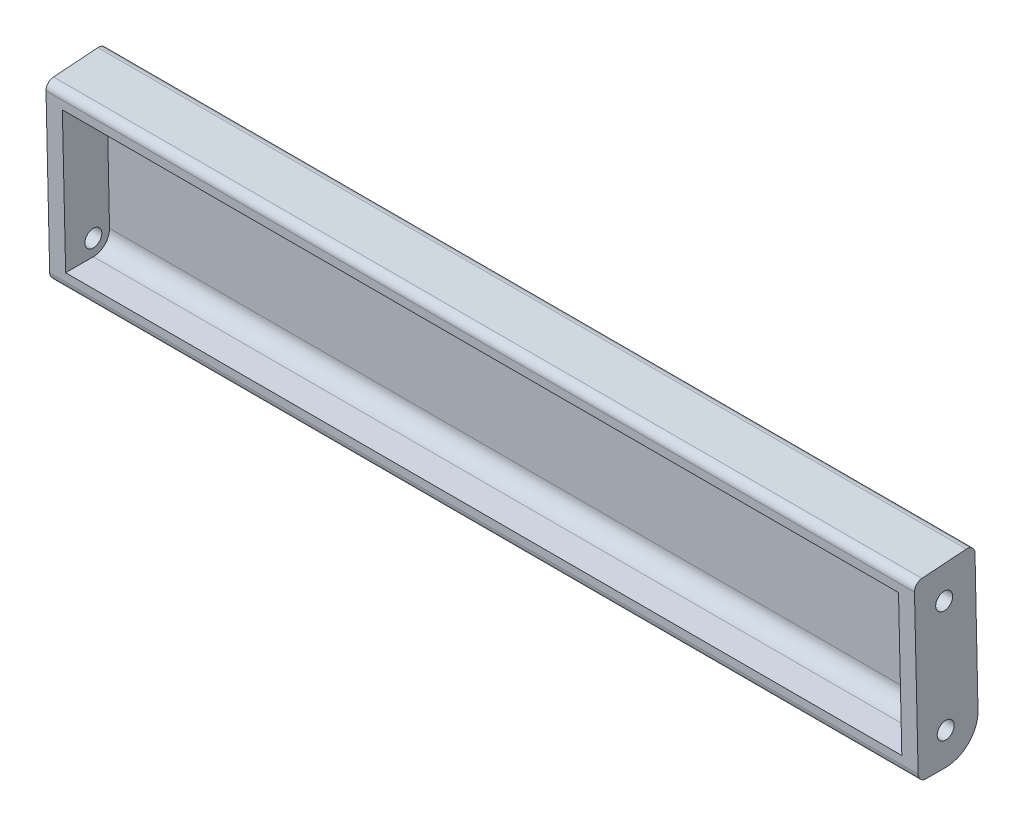
ISO-10303-21;
HEADER;
FILE_DESCRIPTION(('STEP AP214'),'2;1');
FILE_NAME('part.step','',(''),(''),'','','');
FILE_SCHEMA(('AUTOMOTIVE_DESIGN { 1 0 10303 214 1 1 1 1 }'));
ENDSEC;
DATA;
#1=APPLICATION_CONTEXT('core data for automotive mechanical design processes');
#2=APPLICATION_PROTOCOL_DEFINITION('international standard','automotive_design',2000,#1);
#3=PRODUCT_CONTEXT('',#1,'mechanical');
#4=PRODUCT('Part','Part','',(#3));
#5=PRODUCT_RELATED_PRODUCT_CATEGORY('part','',(#4));
#6=PRODUCT_DEFINITION_FORMATION('','',#4);
#7=PRODUCT_DEFINITION_CONTEXT('part definition',#1,'design');
#8=PRODUCT_DEFINITION('design','',#6,#7);
#9=PRODUCT_DEFINITION_SHAPE('','',#8);
#10=(LENGTH_UNIT() NAMED_UNIT(*) SI_UNIT(.MILLI.,.METRE.));
#11=(NAMED_UNIT(*) PLANE_ANGLE_UNIT() SI_UNIT($,.RADIAN.));
#12=(NAMED_UNIT(*) SI_UNIT($,.STERADIAN.) SOLID_ANGLE_UNIT());
#13=UNCERTAINTY_MEASURE_WITH_UNIT(LENGTH_MEASURE(1.E-05),#10,'distance_accuracy_value','');
#14=(GEOMETRIC_REPRESENTATION_CONTEXT(3) GLOBAL_UNCERTAINTY_ASSIGNED_CONTEXT((#13)) GLOBAL_UNIT_ASSIGNED_CONTEXT((#10,
#11,#12)) REPRESENTATION_CONTEXT('',''));
#15=CARTESIAN_POINT('',(0.,0.,0.));
#16=DIRECTION('',(0.,0.,1.));
#17=DIRECTION('',(1.,0.,0.));
#18=AXIS2_PLACEMENT_3D('',#15,#16,#17);
#19=CARTESIAN_POINT('',(215.,26.5821643220677,-62.5359087014566));
#20=DIRECTION('',(0.,0.0230443954174687,-0.999734442659571));
#21=DIRECTION('',(0.,0.999734442659571,0.0230443954174687));
#22=AXIS2_PLACEMENT_3D('',#19,#20,#21);
#23=PLANE('',#22);
#24=DIRECTION('',(0.,-0.999734442659571,-0.0230443954174687));
#25=VECTOR('',#24,1.);
#26=CARTESIAN_POINT('',(0.,26.5821643220677,-62.5359087014566));
#27=LINE('',#26,#25);
#28=CARTESIAN_POINT('',(0.,26.5821643220677,-62.5359087014566));
#29=VERTEX_POINT('',#28);
#30=CARTESIAN_POINT('',(0.,-12.9045774683221,-63.4460985006042));
#31=VERTEX_POINT('',#30);
#32=EDGE_CURVE('E199',#29,#31,#27,.T.);
#33=ORIENTED_EDGE('',*,*,#32,.T.);
#34=DIRECTION('',(-1.,0.,0.));
#35=VECTOR('',#34,1.);
#36=CARTESIAN_POINT('',(215.,-12.9045774683221,-63.4460985006042));
#37=LINE('',#36,#35);
#38=CARTESIAN_POINT('',(215.,-12.9045774683221,-63.4460985006042));
#39=VERTEX_POINT('',#38);
#40=EDGE_CURVE('E229',#39,#31,#37,.T.);
#41=ORIENTED_EDGE('',*,*,#40,.F.);
#42=DIRECTION('',(0.,-0.999734442659571,-0.0230443954174687));
#43=VECTOR('',#42,1.);
#44=CARTESIAN_POINT('',(215.,26.5821643220677,-62.5359087014566));
#45=LINE('',#44,#43);
#46=CARTESIAN_POINT('',(215.,26.5821643220677,-62.5359087014566));
#47=VERTEX_POINT('',#46);
#48=EDGE_CURVE('E181',#47,#39,#45,.T.);
#49=ORIENTED_EDGE('',*,*,#48,.F.);
#50=DIRECTION('',(-1.,0.,0.));
#51=VECTOR('',#50,1.);
#52=CARTESIAN_POINT('',(215.,26.5821643220677,-62.5359087014566));
#53=LINE('',#52,#51);
#54=EDGE_CURVE('E232',#47,#29,#53,.T.);
#55=ORIENTED_EDGE('',*,*,#54,.T.);
#56=EDGE_LOOP('',(#33,#41,#49,#55));
#57=FACE_BOUND('',#56,.T.);
#58=DIRECTION('',(0.,-0.999734442659571,-0.0230443954174687));
#59=VECTOR('',#58,1.);
#60=CARTESIAN_POINT('',(4.,26.5821643220677,-62.5359087014566));
#61=LINE('',#60,#59);
#62=CARTESIAN_POINT('',(4.,24.4841879367445,-62.5842681410607));
#63=VERTEX_POINT('',#62);
#64=CARTESIAN_POINT('',(4.,-10.8584886774871,-63.3989350968609));
#65=VERTEX_POINT('',#64);
#66=EDGE_CURVE('E136',#63,#65,#61,.T.);
#67=ORIENTED_EDGE('',*,*,#66,.F.);
#68=DIRECTION('',(-1.,0.,0.));
#69=VECTOR('',#68,1.);
#70=CARTESIAN_POINT('',(215.,24.4841879367445,-62.5842681410607));
#71=LINE('',#70,#69);
#72=CARTESIAN_POINT('',(211.,24.4841879367445,-62.5842681410607));
#73=VERTEX_POINT('',#72);
#74=EDGE_CURVE('E170',#73,#63,#71,.T.);
#75=ORIENTED_EDGE('',*,*,#74,.F.);
#76=DIRECTION('',(0.,-0.999734442659571,-0.0230443954174687));
#77=VECTOR('',#76,1.);
#78=CARTESIAN_POINT('',(211.,26.5821643220677,-62.5359087014566));
#79=LINE('',#78,#77);
#80=CARTESIAN_POINT('',(211.,-10.8584886774871,-63.3989350968609));
#81=VERTEX_POINT('',#80);
#82=EDGE_CURVE('E167',#73,#81,#79,.T.);
#83=ORIENTED_EDGE('',*,*,#82,.T.);
#84=DIRECTION('',(-1.,0.,0.));
#85=VECTOR('',#84,1.);
#86=CARTESIAN_POINT('',(215.,-10.8584886774871,-63.3989350968609));
#87=LINE('',#86,#85);
#88=EDGE_CURVE('E147',#81,#65,#87,.T.);
#89=ORIENTED_EDGE('',*,*,#88,.T.);
#90=EDGE_LOOP('',(#67,#75,#83,#89));
#91=FACE_BOUND('',#90,.T.);
#92=ADVANCED_FACE('F32',(#57,#91),#23,.F.);
#93=CARTESIAN_POINT('',(215.,26.6282531129027,-64.5353775867758));
#94=DIRECTION('',(-1.,0.,0.));
#95=DIRECTION('',(0.,0.,1.));
#96=AXIS2_PLACEMENT_3D('',#93,#94,#95);
#97=CYLINDRICAL_SURFACE('',#96,2.);
#98=CARTESIAN_POINT('',(0.,26.6282531129027,-64.5353775867758));
#99=DIRECTION('',(1.,0.,0.));
#100=DIRECTION('',(0.,0.,-1.));
#101=AXIS2_PLACEMENT_3D('',#98,#99,#100);
#102=CIRCLE('',#101,2.);
#103=CARTESIAN_POINT('',(0.,28.6231972505984,-64.3932583147773));
#104=VERTEX_POINT('',#103);
#105=EDGE_CURVE('E175',#104,#29,#102,.T.);
#106=ORIENTED_EDGE('',*,*,#105,.T.);
#107=ORIENTED_EDGE('',*,*,#54,.F.);
#108=CARTESIAN_POINT('',(215.,26.6282531129027,-64.5353775867758));
#109=DIRECTION('',(1.,0.,0.));
#110=DIRECTION('',(0.,0.,-1.));
#111=AXIS2_PLACEMENT_3D('',#108,#109,#110);
#112=CIRCLE('',#111,2.);
#113=CARTESIAN_POINT('',(215.,28.6231972505984,-64.3932583147773));
#114=VERTEX_POINT('',#113);
#115=EDGE_CURVE('E178',#114,#47,#112,.T.);
#116=ORIENTED_EDGE('',*,*,#115,.F.);
#117=DIRECTION('',(-1.,0.,0.));
#118=VECTOR('',#117,1.);
#119=CARTESIAN_POINT('',(215.,28.6231972505984,-64.3932583147773));
#120=LINE('',#119,#118);
#121=EDGE_CURVE('E196',#114,#104,#120,.T.);
#122=ORIENTED_EDGE('',*,*,#121,.T.);
#123=EDGE_LOOP('',(#106,#107,#116,#122));
#124=FACE_BOUND('',#123,.T.);
#125=ADVANCED_FACE('F259',(#124),#97,.T.);
#126=CARTESIAN_POINT('',(215.,-12.8584886774871,-65.4455673859233));
#127=DIRECTION('',(-1.,0.,0.));
#128=DIRECTION('',(0.,0.,1.));
#129=AXIS2_PLACEMENT_3D('',#126,#127,#128);
#130=CYLINDRICAL_SURFACE('',#129,2.);
#131=CARTESIAN_POINT('',(0.,-12.8584886774871,-65.4455673859233));
#132=DIRECTION('',(1.,0.,0.));
#133=DIRECTION('',(0.,0.,1.));
#134=AXIS2_PLACEMENT_3D('',#131,#132,#133);
#135=CIRCLE('',#134,2.);
#136=CARTESIAN_POINT('',(0.,-14.8584886774871,-65.4455673859234));
#137=VERTEX_POINT('',#136);
#138=EDGE_CURVE('E201',#31,#137,#135,.T.);
#139=ORIENTED_EDGE('',*,*,#138,.T.);
#140=DIRECTION('',(-1.,0.,0.));
#141=VECTOR('',#140,1.);
#142=CARTESIAN_POINT('',(215.,-14.8584886774871,-65.4455673859234));
#143=LINE('',#142,#141);
#144=CARTESIAN_POINT('',(215.,-14.8584886774871,-65.4455673859234));
#145=VERTEX_POINT('',#144);
#146=EDGE_CURVE('E226',#145,#137,#143,.T.);
#147=ORIENTED_EDGE('',*,*,#146,.F.);
#148=CARTESIAN_POINT('',(215.,-12.8584886774871,-65.4455673859233));
#149=DIRECTION('',(1.,0.,0.));
#150=DIRECTION('',(0.,0.,1.));
#151=AXIS2_PLACEMENT_3D('',#148,#149,#150);
#152=CIRCLE('',#151,2.);
#153=EDGE_CURVE('E184',#39,#145,#152,.T.);
#154=ORIENTED_EDGE('',*,*,#153,.F.);
#155=ORIENTED_EDGE('',*,*,#40,.T.);
#156=EDGE_LOOP('',(#139,#147,#154,#155));
#157=FACE_BOUND('',#156,.T.);
#158=ADVANCED_FACE('F265',(#157),#130,.T.);
#159=CARTESIAN_POINT('',(215.,-14.8584886774871,-70.2619743209976));
#160=DIRECTION('',(0.,1.,0.));
#161=DIRECTION('',(0.,0.,1.));
#162=AXIS2_PLACEMENT_3D('',#159,#160,#161);
#163=PLANE('',#162);
#164=DIRECTION('',(0.,0.,-1.));
#165=VECTOR('',#164,1.);
#166=CARTESIAN_POINT('',(0.,-14.8584886774871,-70.2619743209976));
#167=LINE('',#166,#165);
#168=CARTESIAN_POINT('',(0.,-14.8584886774871,-70.2619743209976));
#169=VERTEX_POINT('',#168);
#170=EDGE_CURVE('E203',#137,#169,#167,.T.);
#171=ORIENTED_EDGE('',*,*,#170,.T.);
#172=DIRECTION('',(-1.,0.,0.));
#173=VECTOR('',#172,1.);
#174=CARTESIAN_POINT('',(215.,-14.8584886774871,-70.2619743209976));
#175=LINE('',#174,#173);
#176=CARTESIAN_POINT('',(215.,-14.8584886774871,-70.2619743209976));
#177=VERTEX_POINT('',#176);
#178=EDGE_CURVE('E223',#177,#169,#175,.T.);
#179=ORIENTED_EDGE('',*,*,#178,.F.);
#180=DIRECTION('',(0.,0.,-1.));
#181=VECTOR('',#180,1.);
#182=CARTESIAN_POINT('',(215.,-14.8584886774871,-70.2619743209976));
#183=LINE('',#182,#181);
#184=EDGE_CURVE('E186',#145,#177,#183,.T.);
#185=ORIENTED_EDGE('',*,*,#184,.F.);
#186=ORIENTED_EDGE('',*,*,#146,.T.);
#187=EDGE_LOOP('',(#171,#179,#185,#186));
#188=FACE_BOUND('',#187,.T.);
#189=ADVANCED_FACE('F270',(#188),#163,.F.);
#190=CARTESIAN_POINT('',(215.,-6.85848867748714,-70.2619743209977));
#191=DIRECTION('',(-1.,0.,0.));
#192=DIRECTION('',(0.,0.,1.));
#193=AXIS2_PLACEMENT_3D('',#190,#191,#192);
#194=CYLINDRICAL_SURFACE('',#193,8.);
#195=CARTESIAN_POINT('',(0.,-6.85848867748714,-70.2619743209977));
#196=DIRECTION('',(1.,0.,0.));
#197=DIRECTION('',(0.,0.,1.));
#198=AXIS2_PLACEMENT_3D('',#195,#196,#197);
#199=CIRCLE('',#198,8.);
#200=CARTESIAN_POINT('',(0.,-6.67527630251636,-78.2598761224489));
#201=VERTEX_POINT('',#200);
#202=EDGE_CURVE('E205',#169,#201,#199,.T.);
#203=ORIENTED_EDGE('',*,*,#202,.T.);
#204=DIRECTION('',(-1.,0.,0.));
#205=VECTOR('',#204,1.);
#206=CARTESIAN_POINT('',(215.,-6.67527630251636,-78.2598761224489));
#207=LINE('',#206,#205);
#208=CARTESIAN_POINT('',(215.,-6.67527630251636,-78.2598761224489));
#209=VERTEX_POINT('',#208);
#210=EDGE_CURVE('E220',#209,#201,#207,.T.);
#211=ORIENTED_EDGE('',*,*,#210,.F.);
#212=CARTESIAN_POINT('',(215.,-6.85848867748714,-70.2619743209977));
#213=DIRECTION('',(1.,0.,0.));
#214=DIRECTION('',(0.,0.,1.));
#215=AXIS2_PLACEMENT_3D('',#212,#213,#214);
#216=CIRCLE('',#215,8.);
#217=EDGE_CURVE('E188',#177,#209,#216,.T.);
#218=ORIENTED_EDGE('',*,*,#217,.F.);
#219=ORIENTED_EDGE('',*,*,#178,.T.);
#220=EDGE_LOOP('',(#203,#211,#218,#219));
#221=FACE_BOUND('',#220,.T.);
#222=ADVANCED_FACE('F274',(#221),#194,.T.);
#223=CARTESIAN_POINT('',(215.,27.4541901626859,-77.521211792415));
#224=DIRECTION('',(0.,-0.0216379411918925,0.999765872342608));
#225=DIRECTION('',(0.,-0.999765872342608,-0.0216379411918925));
#226=AXIS2_PLACEMENT_3D('',#223,#224,#225);
#227=PLANE('',#226);
#228=DIRECTION('',(0.,0.999765872342608,0.0216379411918925));
#229=VECTOR('',#228,1.);
#230=CARTESIAN_POINT('',(0.,27.4541901626859,-77.521211792415));
#231=LINE('',#230,#229);
#232=CARTESIAN_POINT('',(0.,27.4541901626859,-77.521211792415));
#233=VERTEX_POINT('',#232);
#234=EDGE_CURVE('E207',#201,#233,#231,.T.);
#235=ORIENTED_EDGE('',*,*,#234,.T.);
#236=DIRECTION('',(-1.,0.,0.));
#237=VECTOR('',#236,1.);
#238=CARTESIAN_POINT('',(215.,27.4541901626859,-77.521211792415));
#239=LINE('',#238,#237);
#240=CARTESIAN_POINT('',(215.,27.4541901626859,-77.521211792415));
#241=VERTEX_POINT('',#240);
#242=EDGE_CURVE('E217',#241,#233,#239,.T.);
#243=ORIENTED_EDGE('',*,*,#242,.F.);
#244=DIRECTION('',(0.,0.999765872342608,0.0216379411918925));
#245=VECTOR('',#244,1.);
#246=CARTESIAN_POINT('',(215.,27.4541901626859,-77.521211792415));
#247=LINE('',#246,#245);
#248=EDGE_CURVE('E190',#209,#241,#247,.T.);
#249=ORIENTED_EDGE('',*,*,#248,.F.);
#250=ORIENTED_EDGE('',*,*,#210,.T.);
#251=EDGE_LOOP('',(#235,#243,#249,#250));
#252=FACE_BOUND('',#251,.T.);
#253=ADVANCED_FACE('F278',(#252),#227,.F.);
#254=CARTESIAN_POINT('',(215.,27.4109142803022,-75.5216800477298));
#255=DIRECTION('',(-1.,0.,0.));
#256=DIRECTION('',(0.,0.,1.));
#257=AXIS2_PLACEMENT_3D('',#254,#255,#256);
#258=CYLINDRICAL_SURFACE('',#257,2.);
#259=CARTESIAN_POINT('',(0.,27.4109142803022,-75.5216800477298));
#260=DIRECTION('',(1.,0.,0.));
#261=DIRECTION('',(0.,0.,1.));
#262=AXIS2_PLACEMENT_3D('',#259,#260,#261);
#263=CIRCLE('',#262,2.);
#264=CARTESIAN_POINT('',(0.,29.4058584179979,-75.3795607757313));
#265=VERTEX_POINT('',#264);
#266=EDGE_CURVE('E209',#233,#265,#263,.T.);
#267=ORIENTED_EDGE('',*,*,#266,.T.);
#268=DIRECTION('',(-1.,0.,0.));
#269=VECTOR('',#268,1.);
#270=CARTESIAN_POINT('',(215.,29.4058584179979,-75.3795607757313));
#271=LINE('',#270,#269);
#272=CARTESIAN_POINT('',(215.,29.4058584179979,-75.3795607757313));
#273=VERTEX_POINT('',#272);
#274=EDGE_CURVE('E214',#273,#265,#271,.T.);
#275=ORIENTED_EDGE('',*,*,#274,.F.);
#276=CARTESIAN_POINT('',(215.,27.4109142803022,-75.5216800477298));
#277=DIRECTION('',(1.,0.,0.));
#278=DIRECTION('',(0.,0.,1.));
#279=AXIS2_PLACEMENT_3D('',#276,#277,#278);
#280=CIRCLE('',#279,2.);
#281=EDGE_CURVE('E192',#241,#273,#280,.T.);
#282=ORIENTED_EDGE('',*,*,#281,.F.);
#283=ORIENTED_EDGE('',*,*,#242,.T.);
#284=EDGE_LOOP('',(#267,#275,#282,#283));
#285=FACE_BOUND('',#284,.T.);
#286=ADVANCED_FACE('F282',(#285),#258,.T.);
#287=CARTESIAN_POINT('',(215.,28.6231972505984,-64.3932583147773));
#288=DIRECTION('',(0.,-0.997472068847873,-0.0710596359992348));
#289=DIRECTION('',(0.,0.0710596359992348,-0.997472068847873));
#290=AXIS2_PLACEMENT_3D('',#287,#288,#289);
#291=PLANE('',#290);
#292=DIRECTION('',(0.,-0.0710596359992347,0.997472068847873));
#293=VECTOR('',#292,1.);
#294=CARTESIAN_POINT('',(0.,28.6231972505984,-64.3932583147773));
#295=LINE('',#294,#293);
#296=EDGE_CURVE('E182',#265,#104,#295,.T.);
#297=ORIENTED_EDGE('',*,*,#296,.T.);
#298=ORIENTED_EDGE('',*,*,#121,.F.);
#299=DIRECTION('',(0.,-0.0710596359992347,0.997472068847873));
#300=VECTOR('',#299,1.);
#301=CARTESIAN_POINT('',(215.,28.6231972505984,-64.3932583147773));
#302=LINE('',#301,#300);
#303=EDGE_CURVE('E194',#273,#114,#302,.T.);
#304=ORIENTED_EDGE('',*,*,#303,.F.);
#305=ORIENTED_EDGE('',*,*,#274,.T.);
#306=EDGE_LOOP('',(#297,#298,#304,#305));
#307=FACE_BOUND('',#306,.T.);
#308=ADVANCED_FACE('F286',(#307),#291,.F.);
#309=CARTESIAN_POINT('',(215.,26.6282531129027,-64.5353775867758));
#310=DIRECTION('',(1.,0.,0.));
#311=DIRECTION('',(0.,0.,-1.));
#312=AXIS2_PLACEMENT_3D('',#309,#310,#311);
#313=PLANE('',#312);
#314=CARTESIAN_POINT('',(215.,21.0145278342982,-69.8864095452543));
#315=DIRECTION('',(1.,0.,0.));
#316=DIRECTION('',(0.,0.,1.));
#317=AXIS2_PLACEMENT_3D('',#314,#315,#316);
#318=CIRCLE('',#317,2.1);
#319=CARTESIAN_POINT('',(215.,21.0145278342982,-67.7864095452543));
#320=VERTEX_POINT('',#319);
#321=EDGE_CURVE('E335',#320,#320,#318,.T.);
#322=ORIENTED_EDGE('',*,*,#321,.F.);
#323=EDGE_LOOP('',(#322));
#324=FACE_BOUND('',#323,.T.);
#325=CARTESIAN_POINT('',(215.,-6.85848867748715,-70.2619743209976));
#326=DIRECTION('',(1.,0.,0.));
#327=DIRECTION('',(0.,0.,1.));
#328=AXIS2_PLACEMENT_3D('',#325,#326,#327);
#329=CIRCLE('',#328,2.1);
#330=CARTESIAN_POINT('',(215.,-6.85848867748715,-68.1619743209976));
#331=VERTEX_POINT('',#330);
#332=EDGE_CURVE('E342',#331,#331,#329,.T.);
#333=ORIENTED_EDGE('',*,*,#332,.F.);
#334=EDGE_LOOP('',(#333));
#335=FACE_BOUND('',#334,.T.);
#336=ORIENTED_EDGE('',*,*,#115,.T.);
#337=ORIENTED_EDGE('',*,*,#48,.T.);
#338=ORIENTED_EDGE('',*,*,#153,.T.);
#339=ORIENTED_EDGE('',*,*,#184,.T.);
#340=ORIENTED_EDGE('',*,*,#217,.T.);
#341=ORIENTED_EDGE('',*,*,#248,.T.);
#342=ORIENTED_EDGE('',*,*,#281,.T.);
#343=ORIENTED_EDGE('',*,*,#303,.T.);
#344=EDGE_LOOP('',(#336,#337,#338,#339,#340,#341,#342,#343));
#345=FACE_BOUND('',#344,.T.);
#346=ADVANCED_FACE('F290',(#324,#335,#345),#313,.T.);
#347=CARTESIAN_POINT('',(0.,26.6282531129027,-64.5353775867758));
#348=DIRECTION('',(1.,0.,0.));
#349=DIRECTION('',(0.,0.,-1.));
#350=AXIS2_PLACEMENT_3D('',#347,#348,#349);
#351=PLANE('',#350);
#352=CARTESIAN_POINT('',(0.,21.0145278342982,-69.8864095452543));
#353=DIRECTION('',(1.,0.,0.));
#354=DIRECTION('',(0.,0.,1.));
#355=AXIS2_PLACEMENT_3D('',#352,#353,#354);
#356=CIRCLE('',#355,2.1);
#357=CARTESIAN_POINT('',(0.,21.0145278342982,-67.7864095452543));
#358=VERTEX_POINT('',#357);
#359=EDGE_CURVE('E240',#358,#358,#356,.T.);
#360=ORIENTED_EDGE('',*,*,#359,.T.);
#361=EDGE_LOOP('',(#360));
#362=FACE_BOUND('',#361,.T.);
#363=CARTESIAN_POINT('',(0.,-6.85848867748715,-70.2619743209976));
#364=DIRECTION('',(1.,0.,0.));
#365=DIRECTION('',(0.,0.,1.));
#366=AXIS2_PLACEMENT_3D('',#363,#364,#365);
#367=CIRCLE('',#366,2.1);
#368=CARTESIAN_POINT('',(0.,-6.85848867748715,-68.1619743209976));
#369=VERTEX_POINT('',#368);
#370=EDGE_CURVE('E345',#369,#369,#367,.T.);
#371=ORIENTED_EDGE('',*,*,#370,.T.);
#372=EDGE_LOOP('',(#371));
#373=FACE_BOUND('',#372,.T.);
#374=ORIENTED_EDGE('',*,*,#105,.F.);
#375=ORIENTED_EDGE('',*,*,#296,.F.);
#376=ORIENTED_EDGE('',*,*,#266,.F.);
#377=ORIENTED_EDGE('',*,*,#234,.F.);
#378=ORIENTED_EDGE('',*,*,#202,.F.);
#379=ORIENTED_EDGE('',*,*,#170,.F.);
#380=ORIENTED_EDGE('',*,*,#138,.F.);
#381=ORIENTED_EDGE('',*,*,#32,.F.);
#382=EDGE_LOOP('',(#374,#375,#376,#377,#378,#379,#380,#381));
#383=FACE_BOUND('',#382,.T.);
#384=ADVANCED_FACE('F292',(#362,#373,#383),#351,.F.);
#385=CARTESIAN_POINT('',(215.,-10.8584886774871,-70.2619743209976));
#386=DIRECTION('',(0.,1.,0.));
#387=DIRECTION('',(0.,0.,1.));
#388=AXIS2_PLACEMENT_3D('',#385,#386,#387);
#389=PLANE('',#388);
#390=DIRECTION('',(0.,0.,-1.));
#391=VECTOR('',#390,1.);
#392=CARTESIAN_POINT('',(4.,-10.8584886774871,-70.2619743209976));
#393=LINE('',#392,#391);
#394=CARTESIAN_POINT('',(4.,-10.8584886774871,-70.2619743209977));
#395=VERTEX_POINT('',#394);
#396=EDGE_CURVE('E129',#65,#395,#393,.T.);
#397=ORIENTED_EDGE('',*,*,#396,.F.);
#398=ORIENTED_EDGE('',*,*,#88,.F.);
#399=DIRECTION('',(0.,0.,-1.));
#400=VECTOR('',#399,1.);
#401=CARTESIAN_POINT('',(211.,-10.8584886774871,-70.2619743209976));
#402=LINE('',#401,#400);
#403=CARTESIAN_POINT('',(211.,-10.8584886774871,-70.2619743209977));
#404=VERTEX_POINT('',#403);
#405=EDGE_CURVE('E144',#81,#404,#402,.T.);
#406=ORIENTED_EDGE('',*,*,#405,.T.);
#407=DIRECTION('',(-1.,0.,0.));
#408=VECTOR('',#407,1.);
#409=CARTESIAN_POINT('',(215.,-10.8584886774871,-70.2619743209977));
#410=LINE('',#409,#408);
#411=EDGE_CURVE('E142',#404,#395,#410,.T.);
#412=ORIENTED_EDGE('',*,*,#411,.T.);
#413=EDGE_LOOP('',(#397,#398,#406,#412));
#414=FACE_BOUND('',#413,.T.);
#415=ADVANCED_FACE('F143',(#414),#389,.T.);
#416=CARTESIAN_POINT('',(215.,-6.85848867748714,-70.2619743209977));
#417=DIRECTION('',(-1.,0.,0.));
#418=DIRECTION('',(0.,0.,1.));
#419=AXIS2_PLACEMENT_3D('',#416,#417,#418);
#420=CYLINDRICAL_SURFACE('',#419,4.);
#421=CARTESIAN_POINT('',(4.,-6.85848867748714,-70.2619743209977));
#422=DIRECTION('',(1.,0.,0.));
#423=DIRECTION('',(0.,0.,-1.));
#424=AXIS2_PLACEMENT_3D('',#421,#422,#423);
#425=CIRCLE('',#424,4.);
#426=CARTESIAN_POINT('',(4.,-6.76182806728393,-74.2608126330785));
#427=VERTEX_POINT('',#426);
#428=EDGE_CURVE('E133',#395,#427,#425,.T.);
#429=ORIENTED_EDGE('',*,*,#428,.F.);
#430=ORIENTED_EDGE('',*,*,#411,.F.);
#431=CARTESIAN_POINT('',(211.,-6.85848867748714,-70.2619743209977));
#432=DIRECTION('',(1.,0.,0.));
#433=DIRECTION('',(0.,0.,-1.));
#434=AXIS2_PLACEMENT_3D('',#431,#432,#433);
#435=CIRCLE('',#434,4.);
#436=CARTESIAN_POINT('',(211.,-6.76182806728393,-74.2608126330785));
#437=VERTEX_POINT('',#436);
#438=EDGE_CURVE('E161',#404,#437,#435,.T.);
#439=ORIENTED_EDGE('',*,*,#438,.T.);
#440=DIRECTION('',(1.,0.,0.));
#441=VECTOR('',#440,1.);
#442=CARTESIAN_POINT('',(215.,-6.76182806728393,-74.2608126330785));
#443=LINE('',#442,#441);
#444=EDGE_CURVE('E148',#437,#427,#443,.F.);
#445=ORIENTED_EDGE('',*,*,#444,.T.);
#446=EDGE_LOOP('',(#429,#430,#439,#445));
#447=FACE_BOUND('',#446,.T.);
#448=ADVANCED_FACE('F150',(#447),#420,.F.);
#449=CARTESIAN_POINT('',(215.,27.3676383979184,-73.5221483030446));
#450=DIRECTION('',(0.,-0.0216379411918925,0.999765872342608));
#451=DIRECTION('',(0.,-0.999765872342608,-0.0216379411918925));
#452=AXIS2_PLACEMENT_3D('',#449,#450,#451);
#453=PLANE('',#452);
#454=DIRECTION('',(0.,0.999765872342608,0.0216379411918925));
#455=VECTOR('',#454,1.);
#456=CARTESIAN_POINT('',(211.,27.3676383979184,-73.5221483030446));
#457=LINE('',#456,#455);
#458=CARTESIAN_POINT('',(211.,23.1656394461769,-73.6130922017327));
#459=VERTEX_POINT('',#458);
#460=EDGE_CURVE('E162',#437,#459,#457,.T.);
#461=ORIENTED_EDGE('',*,*,#460,.T.);
#462=DIRECTION('',(-1.,0.,0.));
#463=VECTOR('',#462,1.);
#464=CARTESIAN_POINT('',(4.,23.1656394461769,-73.6130922017327));
#465=LINE('',#464,#463);
#466=CARTESIAN_POINT('',(4.,23.1656394461769,-73.6130922017327));
#467=VERTEX_POINT('',#466);
#468=EDGE_CURVE('E235',#459,#467,#465,.T.);
#469=ORIENTED_EDGE('',*,*,#468,.T.);
#470=DIRECTION('',(0.,0.999765872342608,0.0216379411918925));
#471=VECTOR('',#470,1.);
#472=CARTESIAN_POINT('',(4.,27.3676383979184,-73.5221483030446));
#473=LINE('',#472,#471);
#474=EDGE_CURVE('E153',#427,#467,#473,.T.);
#475=ORIENTED_EDGE('',*,*,#474,.F.);
#476=ORIENTED_EDGE('',*,*,#444,.F.);
#477=EDGE_LOOP('',(#461,#469,#475,#476));
#478=FACE_BOUND('',#477,.T.);
#479=ADVANCED_FACE('F248',(#478),#453,.T.);
#480=CARTESIAN_POINT('',(215.,24.6333089752069,-64.6774968587742));
#481=DIRECTION('',(0.,-0.997472068847873,-0.0710596359992348));
#482=DIRECTION('',(0.,0.0710596359992348,-0.997472068847873));
#483=AXIS2_PLACEMENT_3D('',#480,#481,#482);
#484=PLANE('',#483);
#485=DIRECTION('',(0.,-0.0710596359992348,0.997472068847873));
#486=VECTOR('',#485,1.);
#487=CARTESIAN_POINT('',(4.,24.6333089752069,-64.6774968587742));
#488=LINE('',#487,#486);
#489=CARTESIAN_POINT('',(4.,25.1173077014888,-71.471441185049));
#490=VERTEX_POINT('',#489);
#491=EDGE_CURVE('E155',#490,#63,#488,.T.);
#492=ORIENTED_EDGE('',*,*,#491,.F.);
#493=DIRECTION('',(-1.,0.,0.));
#494=VECTOR('',#493,1.);
#495=CARTESIAN_POINT('',(211.,25.1173077014888,-71.471441185049));
#496=LINE('',#495,#494);
#497=CARTESIAN_POINT('',(211.,25.1173077014888,-71.471441185049));
#498=VERTEX_POINT('',#497);
#499=EDGE_CURVE('E40',#490,#498,#496,.F.);
#500=ORIENTED_EDGE('',*,*,#499,.T.);
#501=DIRECTION('',(0.,-0.0710596359992348,0.997472068847873));
#502=VECTOR('',#501,1.);
#503=CARTESIAN_POINT('',(211.,24.6333089752069,-64.6774968587742));
#504=LINE('',#503,#502);
#505=EDGE_CURVE('E160',#498,#73,#504,.T.);
#506=ORIENTED_EDGE('',*,*,#505,.T.);
#507=ORIENTED_EDGE('',*,*,#74,.T.);
#508=EDGE_LOOP('',(#492,#500,#506,#507));
#509=FACE_BOUND('',#508,.T.);
#510=ADVANCED_FACE('F256',(#509),#484,.T.);
#511=CARTESIAN_POINT('',(211.,26.6282531129027,-64.5353775867758));
#512=DIRECTION('',(1.,0.,0.));
#513=DIRECTION('',(0.,0.,-1.));
#514=AXIS2_PLACEMENT_3D('',#511,#512,#513);
#515=PLANE('',#514);
#516=CARTESIAN_POINT('',(211.,21.0145278342982,-69.8864095452543));
#517=DIRECTION('',(1.,0.,0.));
#518=DIRECTION('',(0.,0.,-1.));
#519=AXIS2_PLACEMENT_3D('',#516,#517,#518);
#520=CIRCLE('',#519,2.1);
#521=CARTESIAN_POINT('',(211.,21.0145278342982,-71.9864095452543));
#522=VERTEX_POINT('',#521);
#523=EDGE_CURVE('E177',#522,#522,#520,.T.);
#524=ORIENTED_EDGE('',*,*,#523,.T.);
#525=EDGE_LOOP('',(#524));
#526=FACE_BOUND('',#525,.T.);
#527=CARTESIAN_POINT('',(211.,-6.85848867748715,-70.2619743209976));
#528=DIRECTION('',(1.,0.,0.));
#529=DIRECTION('',(0.,0.,-1.));
#530=AXIS2_PLACEMENT_3D('',#527,#528,#529);
#531=CIRCLE('',#530,2.1);
#532=CARTESIAN_POINT('',(211.,-6.85848867748715,-72.3619743209976));
#533=VERTEX_POINT('',#532);
#534=EDGE_CURVE('E239',#533,#533,#531,.T.);
#535=ORIENTED_EDGE('',*,*,#534,.T.);
#536=EDGE_LOOP('',(#535));
#537=FACE_BOUND('',#536,.T.);
#538=ORIENTED_EDGE('',*,*,#505,.F.);
#539=CARTESIAN_POINT('',(211.,23.1223635637931,-71.6135604570475));
#540=DIRECTION('',(1.,0.,0.));
#541=DIRECTION('',(0.,0.,-1.));
#542=AXIS2_PLACEMENT_3D('',#539,#540,#541);
#543=CIRCLE('',#542,2.);
#544=EDGE_CURVE('E11',#498,#459,#543,.F.);
#545=ORIENTED_EDGE('',*,*,#544,.T.);
#546=ORIENTED_EDGE('',*,*,#460,.F.);
#547=ORIENTED_EDGE('',*,*,#438,.F.);
#548=ORIENTED_EDGE('',*,*,#405,.F.);
#549=ORIENTED_EDGE('',*,*,#82,.F.);
#550=EDGE_LOOP('',(#538,#545,#546,#547,#548,#549));
#551=FACE_BOUND('',#550,.T.);
#552=ADVANCED_FACE('F253',(#526,#537,#551),#515,.F.);
#553=CARTESIAN_POINT('',(4.,26.6282531129027,-64.5353775867758));
#554=DIRECTION('',(1.,0.,0.));
#555=DIRECTION('',(0.,0.,-1.));
#556=AXIS2_PLACEMENT_3D('',#553,#554,#555);
#557=PLANE('',#556);
#558=CARTESIAN_POINT('',(4.,21.0145278342982,-69.8864095452543));
#559=DIRECTION('',(1.,0.,0.));
#560=DIRECTION('',(0.,0.,-1.));
#561=AXIS2_PLACEMENT_3D('',#558,#559,#560);
#562=CIRCLE('',#561,2.1);
#563=CARTESIAN_POINT('',(4.,21.0145278342982,-71.9864095452543));
#564=VERTEX_POINT('',#563);
#565=EDGE_CURVE('E241',#564,#564,#562,.T.);
#566=ORIENTED_EDGE('',*,*,#565,.F.);
#567=EDGE_LOOP('',(#566));
#568=FACE_BOUND('',#567,.T.);
#569=CARTESIAN_POINT('',(4.,-6.85848867748715,-70.2619743209976));
#570=DIRECTION('',(1.,0.,0.));
#571=DIRECTION('',(0.,0.,-1.));
#572=AXIS2_PLACEMENT_3D('',#569,#570,#571);
#573=CIRCLE('',#572,2.1);
#574=CARTESIAN_POINT('',(4.,-6.85848867748715,-72.3619743209976));
#575=VERTEX_POINT('',#574);
#576=EDGE_CURVE('E236',#575,#575,#573,.T.);
#577=ORIENTED_EDGE('',*,*,#576,.F.);
#578=EDGE_LOOP('',(#577));
#579=FACE_BOUND('',#578,.T.);
#580=ORIENTED_EDGE('',*,*,#474,.T.);
#581=CARTESIAN_POINT('',(4.,23.1223635637931,-71.6135604570475));
#582=DIRECTION('',(1.,0.,0.));
#583=DIRECTION('',(0.,0.,-1.));
#584=AXIS2_PLACEMENT_3D('',#581,#582,#583);
#585=CIRCLE('',#584,2.);
#586=EDGE_CURVE('E54',#467,#490,#585,.T.);
#587=ORIENTED_EDGE('',*,*,#586,.T.);
#588=ORIENTED_EDGE('',*,*,#491,.T.);
#589=ORIENTED_EDGE('',*,*,#66,.T.);
#590=ORIENTED_EDGE('',*,*,#396,.T.);
#591=ORIENTED_EDGE('',*,*,#428,.T.);
#592=EDGE_LOOP('',(#580,#587,#588,#589,#590,#591));
#593=FACE_BOUND('',#592,.T.);
#594=ADVANCED_FACE('F131',(#568,#579,#593),#557,.T.);
#595=CARTESIAN_POINT('',(0.,-6.85848867748715,-70.2619743209976));
#596=DIRECTION('',(1.,0.,0.));
#597=DIRECTION('',(0.,0.,-1.));
#598=AXIS2_PLACEMENT_3D('',#595,#596,#597);
#599=CYLINDRICAL_SURFACE('',#598,2.1);
#600=ORIENTED_EDGE('',*,*,#576,.T.);
#601=EDGE_LOOP('',(#600));
#602=FACE_BOUND('',#601,.T.);
#603=ORIENTED_EDGE('',*,*,#370,.F.);
#604=EDGE_LOOP('',(#603));
#605=FACE_BOUND('',#604,.T.);
#606=ADVANCED_FACE('F301',(#602,#605),#599,.F.);
#607=CARTESIAN_POINT('',(0.,21.0145278342982,-69.8864095452543));
#608=DIRECTION('',(1.,0.,0.));
#609=DIRECTION('',(0.,0.,-1.));
#610=AXIS2_PLACEMENT_3D('',#607,#608,#609);
#611=CYLINDRICAL_SURFACE('',#610,2.1);
#612=ORIENTED_EDGE('',*,*,#565,.T.);
#613=EDGE_LOOP('',(#612));
#614=FACE_BOUND('',#613,.T.);
#615=ORIENTED_EDGE('',*,*,#359,.F.);
#616=EDGE_LOOP('',(#615));
#617=FACE_BOUND('',#616,.T.);
#618=ADVANCED_FACE('F316',(#614,#617),#611,.F.);
#619=ORIENTED_EDGE('',*,*,#332,.T.);
#620=EDGE_LOOP('',(#619));
#621=FACE_BOUND('',#620,.T.);
#622=ORIENTED_EDGE('',*,*,#534,.F.);
#623=EDGE_LOOP('',(#622));
#624=FACE_BOUND('',#623,.T.);
#625=ADVANCED_FACE('F318',(#621,#624),#599,.F.);
#626=ORIENTED_EDGE('',*,*,#321,.T.);
#627=EDGE_LOOP('',(#626));
#628=FACE_BOUND('',#627,.T.);
#629=ORIENTED_EDGE('',*,*,#523,.F.);
#630=EDGE_LOOP('',(#629));
#631=FACE_BOUND('',#630,.T.);
#632=ADVANCED_FACE('F321',(#628,#631),#611,.F.);
#633=CARTESIAN_POINT('',(215.,23.1223635637931,-71.6135604570475));
#634=DIRECTION('',(1.,0.,0.));
#635=DIRECTION('',(0.,0.,-1.));
#636=AXIS2_PLACEMENT_3D('',#633,#634,#635);
#637=CYLINDRICAL_SURFACE('',#636,2.);
#638=ORIENTED_EDGE('',*,*,#544,.F.);
#639=ORIENTED_EDGE('',*,*,#499,.F.);
#640=ORIENTED_EDGE('',*,*,#586,.F.);
#641=ORIENTED_EDGE('',*,*,#468,.F.);
#642=EDGE_LOOP('',(#638,#639,#640,#641));
#643=FACE_BOUND('',#642,.T.);
#644=ADVANCED_FACE('F34',(#643),#637,.F.);
#645=CLOSED_SHELL('',(#92,#125,#158,#189,#222,#253,#286,#308,#346,#384,#415,#448,#479,#510,#552,
#594,#606,#618,#625,#632,#644));
#646=MANIFOLD_SOLID_BREP('B2',#645);
#647=ADVANCED_BREP_SHAPE_REPRESENTATION('',(#18,#646),#14);
#648=SHAPE_DEFINITION_REPRESENTATION(#9,#647);
ENDSEC;
END-ISO-10303-21;
